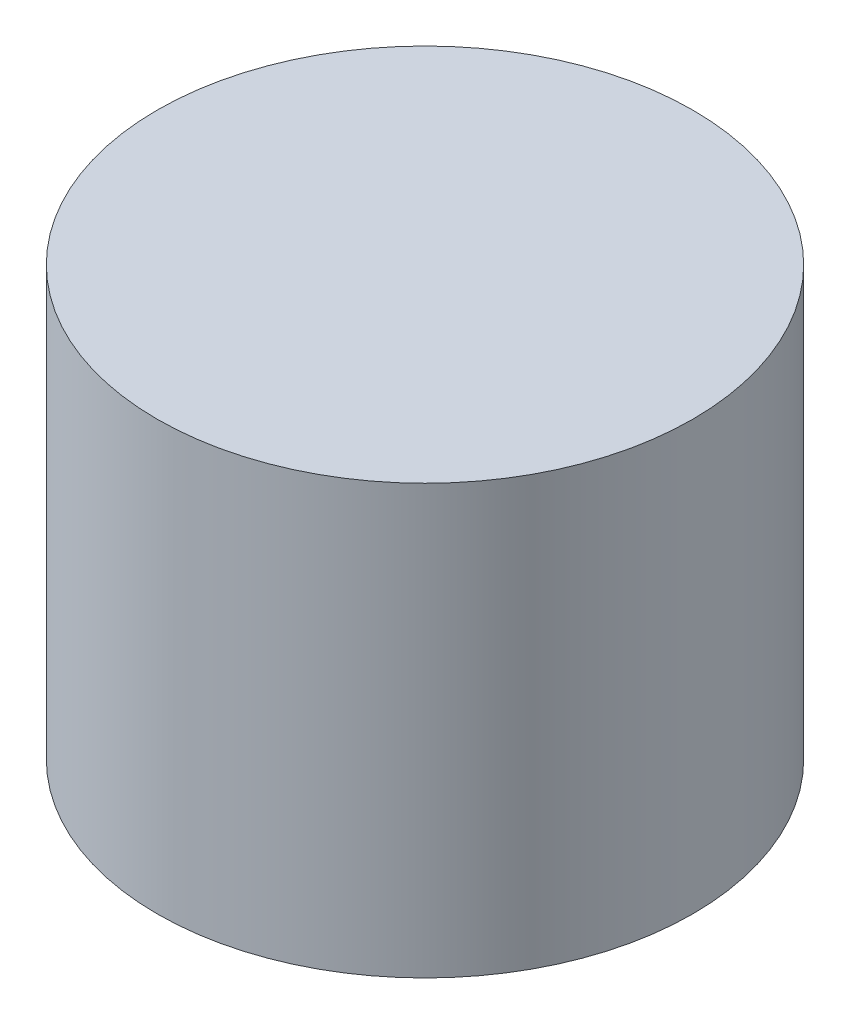
ISO-10303-21;
HEADER;
FILE_DESCRIPTION(('STEP AP214'),'2;1');
FILE_NAME('part.step','',(''),(''),'','','');
FILE_SCHEMA(('AUTOMOTIVE_DESIGN { 1 0 10303 214 1 1 1 1 }'));
ENDSEC;
DATA;
#1=APPLICATION_CONTEXT('core data for automotive mechanical design processes');
#2=APPLICATION_PROTOCOL_DEFINITION('international standard','automotive_design',2000,#1);
#3=PRODUCT_CONTEXT('',#1,'mechanical');
#4=PRODUCT('Part','Part','',(#3));
#5=PRODUCT_RELATED_PRODUCT_CATEGORY('part','',(#4));
#6=PRODUCT_DEFINITION_FORMATION('','',#4);
#7=PRODUCT_DEFINITION_CONTEXT('part definition',#1,'design');
#8=PRODUCT_DEFINITION('design','',#6,#7);
#9=PRODUCT_DEFINITION_SHAPE('','',#8);
#10=(LENGTH_UNIT() NAMED_UNIT(*) SI_UNIT(.MILLI.,.METRE.));
#11=(NAMED_UNIT(*) PLANE_ANGLE_UNIT() SI_UNIT($,.RADIAN.));
#12=(NAMED_UNIT(*) SI_UNIT($,.STERADIAN.) SOLID_ANGLE_UNIT());
#13=UNCERTAINTY_MEASURE_WITH_UNIT(LENGTH_MEASURE(1.E-05),#10,'distance_accuracy_value','');
#14=(GEOMETRIC_REPRESENTATION_CONTEXT(3) GLOBAL_UNCERTAINTY_ASSIGNED_CONTEXT((#13)) GLOBAL_UNIT_ASSIGNED_CONTEXT((#10,
#11,#12)) REPRESENTATION_CONTEXT('',''));
#15=CARTESIAN_POINT('',(0.,0.,0.));
#16=DIRECTION('',(0.,0.,1.));
#17=DIRECTION('',(1.,0.,0.));
#18=AXIS2_PLACEMENT_3D('',#15,#16,#17);
#19=CARTESIAN_POINT('',(0.,101.6,0.));
#20=DIRECTION('',(0.,-1.,0.));
#21=DIRECTION('',(0.,0.,-1.));
#22=AXIS2_PLACEMENT_3D('',#19,#20,#21);
#23=CYLINDRICAL_SURFACE('',#22,63.5);
#24=CARTESIAN_POINT('',(0.,101.6,0.));
#25=DIRECTION('',(0.,1.,0.));
#26=DIRECTION('',(0.,0.,1.));
#27=AXIS2_PLACEMENT_3D('',#24,#25,#26);
#28=CIRCLE('',#27,63.5);
#29=CARTESIAN_POINT('',(0.,101.6,63.5));
#30=VERTEX_POINT('',#29);
#31=EDGE_CURVE('E10',#30,#30,#28,.T.);
#32=ORIENTED_EDGE('',*,*,#31,.F.);
#33=EDGE_LOOP('',(#32));
#34=FACE_BOUND('',#33,.T.);
#35=CARTESIAN_POINT('',(0.,0.,0.));
#36=DIRECTION('',(0.,1.,0.));
#37=DIRECTION('',(0.,0.,1.));
#38=AXIS2_PLACEMENT_3D('',#35,#36,#37);
#39=CIRCLE('',#38,63.5);
#40=CARTESIAN_POINT('',(0.,0.,63.5));
#41=VERTEX_POINT('',#40);
#42=EDGE_CURVE('E46',#41,#41,#39,.T.);
#43=ORIENTED_EDGE('',*,*,#42,.T.);
#44=EDGE_LOOP('',(#43));
#45=FACE_BOUND('',#44,.T.);
#46=ADVANCED_FACE('F43',(#34,#45),#23,.T.);
#47=CARTESIAN_POINT('',(0.,101.6,0.));
#48=DIRECTION('',(0.,1.,0.));
#49=DIRECTION('',(0.,0.,1.));
#50=AXIS2_PLACEMENT_3D('',#47,#48,#49);
#51=PLANE('',#50);
#52=ORIENTED_EDGE('',*,*,#31,.T.);
#53=EDGE_LOOP('',(#52));
#54=FACE_BOUND('',#53,.T.);
#55=ADVANCED_FACE('F60',(#54),#51,.T.);
#56=CARTESIAN_POINT('',(0.,0.,0.));
#57=DIRECTION('',(0.,1.,0.));
#58=DIRECTION('',(0.,0.,1.));
#59=AXIS2_PLACEMENT_3D('',#56,#57,#58);
#60=PLANE('',#59);
#61=ORIENTED_EDGE('',*,*,#42,.F.);
#62=EDGE_LOOP('',(#61));
#63=FACE_BOUND('',#62,.T.);
#64=ADVANCED_FACE('F58',(#63),#60,.F.);
#65=CLOSED_SHELL('',(#46,#55,#64));
#66=MANIFOLD_SOLID_BREP('B2',#65);
#67=ADVANCED_BREP_SHAPE_REPRESENTATION('',(#18,#66),#14);
#68=SHAPE_DEFINITION_REPRESENTATION(#9,#67);
ENDSEC;
END-ISO-10303-21;
